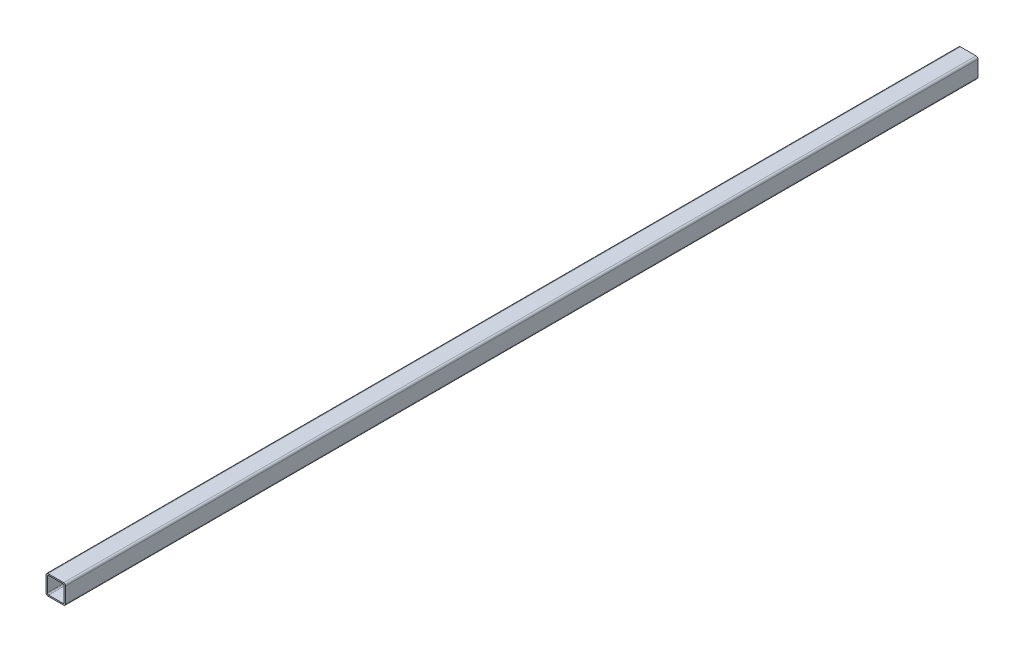
ISO-10303-21;
HEADER;
FILE_DESCRIPTION(('STEP AP214'),'2;1');
FILE_NAME('part.step','',(''),(''),'','','');
FILE_SCHEMA(('AUTOMOTIVE_DESIGN { 1 0 10303 214 1 1 1 1 }'));
ENDSEC;
DATA;
#1=APPLICATION_CONTEXT('core data for automotive mechanical design processes');
#2=APPLICATION_PROTOCOL_DEFINITION('international standard','automotive_design',2000,#1);
#3=PRODUCT_CONTEXT('',#1,'mechanical');
#4=PRODUCT('Part','Part','',(#3));
#5=PRODUCT_RELATED_PRODUCT_CATEGORY('part','',(#4));
#6=PRODUCT_DEFINITION_FORMATION('','',#4);
#7=PRODUCT_DEFINITION_CONTEXT('part definition',#1,'design');
#8=PRODUCT_DEFINITION('design','',#6,#7);
#9=PRODUCT_DEFINITION_SHAPE('','',#8);
#10=(LENGTH_UNIT() NAMED_UNIT(*) SI_UNIT(.MILLI.,.METRE.));
#11=(NAMED_UNIT(*) PLANE_ANGLE_UNIT() SI_UNIT($,.RADIAN.));
#12=(NAMED_UNIT(*) SI_UNIT($,.STERADIAN.) SOLID_ANGLE_UNIT());
#13=UNCERTAINTY_MEASURE_WITH_UNIT(LENGTH_MEASURE(1.E-05),#10,'distance_accuracy_value','');
#14=(GEOMETRIC_REPRESENTATION_CONTEXT(3) GLOBAL_UNCERTAINTY_ASSIGNED_CONTEXT((#13)) GLOBAL_UNIT_ASSIGNED_CONTEXT((#10,
#11,#12)) REPRESENTATION_CONTEXT('',''));
#15=CARTESIAN_POINT('',(0.,0.,0.));
#16=DIRECTION('',(0.,0.,1.));
#17=DIRECTION('',(1.,0.,0.));
#18=AXIS2_PLACEMENT_3D('',#15,#16,#17);
#19=CARTESIAN_POINT('',(-28.3889209690526,12.,742.426406871193));
#20=DIRECTION('',(1.,0.,0.));
#21=DIRECTION('',(0.,0.,-1.));
#22=AXIS2_PLACEMENT_3D('',#19,#20,#21);
#23=PLANE('',#22);
#24=DIRECTION('',(0.,-1.,0.));
#25=VECTOR('',#24,1.);
#26=CARTESIAN_POINT('',(-28.3889209690526,12.,700.));
#27=LINE('',#26,#25);
#28=CARTESIAN_POINT('',(-28.3889209690526,12.,700.));
#29=VERTEX_POINT('',#28);
#30=CARTESIAN_POINT('',(-28.3889209690526,-12.,700.));
#31=VERTEX_POINT('',#30);
#32=EDGE_CURVE('E196',#29,#31,#27,.T.);
#33=ORIENTED_EDGE('',*,*,#32,.F.);
#34=DIRECTION('',(0.,0.,-1.));
#35=VECTOR('',#34,1.);
#36=CARTESIAN_POINT('',(-28.3889209690526,12.,742.426406871193));
#37=LINE('',#36,#35);
#38=CARTESIAN_POINT('',(-28.3889209690526,12.,-700.));
#39=VERTEX_POINT('',#38);
#40=EDGE_CURVE('E49',#29,#39,#37,.T.);
#41=ORIENTED_EDGE('',*,*,#40,.T.);
#42=DIRECTION('',(0.,-1.,0.));
#43=VECTOR('',#42,1.);
#44=CARTESIAN_POINT('',(-28.3889209690526,12.,-700.));
#45=LINE('',#44,#43);
#46=CARTESIAN_POINT('',(-28.3889209690526,-12.,-700.));
#47=VERTEX_POINT('',#46);
#48=EDGE_CURVE('E272',#39,#47,#45,.T.);
#49=ORIENTED_EDGE('',*,*,#48,.T.);
#50=DIRECTION('',(0.,0.,-1.));
#51=VECTOR('',#50,1.);
#52=CARTESIAN_POINT('',(-28.3889209690526,-12.,742.426406871193));
#53=LINE('',#52,#51);
#54=EDGE_CURVE('E232',#31,#47,#53,.T.);
#55=ORIENTED_EDGE('',*,*,#54,.F.);
#56=EDGE_LOOP('',(#33,#41,#49,#55));
#57=FACE_BOUND('',#56,.T.);
#58=ADVANCED_FACE('F34',(#57),#23,.F.);
#59=CARTESIAN_POINT('',(-25.3889209690526,12.,742.426406871193));
#60=DIRECTION('',(0.,0.,-1.));
#61=DIRECTION('',(-1.,0.,0.));
#62=AXIS2_PLACEMENT_3D('',#59,#60,#61);
#63=CYLINDRICAL_SURFACE('',#62,3.);
#64=CARTESIAN_POINT('',(-25.3889209690526,12.,700.));
#65=DIRECTION('',(0.,0.,1.));
#66=DIRECTION('',(1.,0.,0.));
#67=AXIS2_PLACEMENT_3D('',#64,#65,#66);
#68=CIRCLE('',#67,3.);
#69=CARTESIAN_POINT('',(-25.3889209690525,15.,700.));
#70=VERTEX_POINT('',#69);
#71=EDGE_CURVE('E199',#70,#29,#68,.T.);
#72=ORIENTED_EDGE('',*,*,#71,.F.);
#73=DIRECTION('',(0.,0.,-1.));
#74=VECTOR('',#73,1.);
#75=CARTESIAN_POINT('',(-25.3889209690525,15.,742.426406871193));
#76=LINE('',#75,#74);
#77=CARTESIAN_POINT('',(-25.3889209690525,15.,-700.));
#78=VERTEX_POINT('',#77);
#79=EDGE_CURVE('E235',#70,#78,#76,.T.);
#80=ORIENTED_EDGE('',*,*,#79,.T.);
#81=CARTESIAN_POINT('',(-25.3889209690526,12.,-700.));
#82=DIRECTION('',(0.,0.,1.));
#83=DIRECTION('',(1.,0.,0.));
#84=AXIS2_PLACEMENT_3D('',#81,#82,#83);
#85=CIRCLE('',#84,3.);
#86=EDGE_CURVE('E270',#78,#39,#85,.T.);
#87=ORIENTED_EDGE('',*,*,#86,.T.);
#88=ORIENTED_EDGE('',*,*,#40,.F.);
#89=EDGE_LOOP('',(#72,#80,#87,#88));
#90=FACE_BOUND('',#89,.T.);
#91=ADVANCED_FACE('F320',(#90),#63,.T.);
#92=CARTESIAN_POINT('',(-25.3889209690525,15.,742.426406871193));
#93=DIRECTION('',(0.,-1.,0.));
#94=DIRECTION('',(0.,0.,-1.));
#95=AXIS2_PLACEMENT_3D('',#92,#93,#94);
#96=PLANE('',#95);
#97=DIRECTION('',(-1.,0.,0.));
#98=VECTOR('',#97,1.);
#99=CARTESIAN_POINT('',(-25.3889209690525,15.,700.));
#100=LINE('',#99,#98);
#101=CARTESIAN_POINT('',(-1.38892096905256,15.,700.));
#102=VERTEX_POINT('',#101);
#103=EDGE_CURVE('E202',#102,#70,#100,.T.);
#104=ORIENTED_EDGE('',*,*,#103,.F.);
#105=DIRECTION('',(0.,0.,-1.));
#106=VECTOR('',#105,1.);
#107=CARTESIAN_POINT('',(-1.38892096905256,15.,742.426406871193));
#108=LINE('',#107,#106);
#109=CARTESIAN_POINT('',(-1.38892096905256,15.,-700.));
#110=VERTEX_POINT('',#109);
#111=EDGE_CURVE('E237',#102,#110,#108,.T.);
#112=ORIENTED_EDGE('',*,*,#111,.T.);
#113=DIRECTION('',(-1.,0.,0.));
#114=VECTOR('',#113,1.);
#115=CARTESIAN_POINT('',(-25.3889209690525,15.,-700.));
#116=LINE('',#115,#114);
#117=EDGE_CURVE('E267',#110,#78,#116,.T.);
#118=ORIENTED_EDGE('',*,*,#117,.T.);
#119=ORIENTED_EDGE('',*,*,#79,.F.);
#120=EDGE_LOOP('',(#104,#112,#118,#119));
#121=FACE_BOUND('',#120,.T.);
#122=ADVANCED_FACE('F325',(#121),#96,.F.);
#123=CARTESIAN_POINT('',(-1.38892096905256,12.,742.426406871193));
#124=DIRECTION('',(0.,0.,-1.));
#125=DIRECTION('',(-1.,0.,0.));
#126=AXIS2_PLACEMENT_3D('',#123,#124,#125);
#127=CYLINDRICAL_SURFACE('',#126,3.);
#128=CARTESIAN_POINT('',(-1.38892096905256,12.,700.));
#129=DIRECTION('',(0.,0.,1.));
#130=DIRECTION('',(1.,0.,0.));
#131=AXIS2_PLACEMENT_3D('',#128,#129,#130);
#132=CIRCLE('',#131,3.);
#133=CARTESIAN_POINT('',(1.61107903094744,12.,700.));
#134=VERTEX_POINT('',#133);
#135=EDGE_CURVE('E205',#134,#102,#132,.T.);
#136=ORIENTED_EDGE('',*,*,#135,.F.);
#137=DIRECTION('',(0.,0.,-1.));
#138=VECTOR('',#137,1.);
#139=CARTESIAN_POINT('',(1.61107903094744,12.,742.426406871193));
#140=LINE('',#139,#138);
#141=CARTESIAN_POINT('',(1.61107903094744,12.,-700.));
#142=VERTEX_POINT('',#141);
#143=EDGE_CURVE('E239',#134,#142,#140,.T.);
#144=ORIENTED_EDGE('',*,*,#143,.T.);
#145=CARTESIAN_POINT('',(-1.38892096905256,12.,-700.));
#146=DIRECTION('',(0.,0.,1.));
#147=DIRECTION('',(1.,0.,0.));
#148=AXIS2_PLACEMENT_3D('',#145,#146,#147);
#149=CIRCLE('',#148,3.);
#150=EDGE_CURVE('E264',#142,#110,#149,.T.);
#151=ORIENTED_EDGE('',*,*,#150,.T.);
#152=ORIENTED_EDGE('',*,*,#111,.F.);
#153=EDGE_LOOP('',(#136,#144,#151,#152));
#154=FACE_BOUND('',#153,.T.);
#155=ADVANCED_FACE('F330',(#154),#127,.T.);
#156=CARTESIAN_POINT('',(1.61107903094744,12.,742.426406871193));
#157=DIRECTION('',(-1.,0.,0.));
#158=DIRECTION('',(0.,-1.,0.));
#159=AXIS2_PLACEMENT_3D('',#156,#157,#158);
#160=PLANE('',#159);
#161=DIRECTION('',(0.,1.,0.));
#162=VECTOR('',#161,1.);
#163=CARTESIAN_POINT('',(1.61107903094744,12.,700.));
#164=LINE('',#163,#162);
#165=CARTESIAN_POINT('',(1.61107903094744,-12.,700.));
#166=VERTEX_POINT('',#165);
#167=EDGE_CURVE('E208',#166,#134,#164,.T.);
#168=ORIENTED_EDGE('',*,*,#167,.F.);
#169=DIRECTION('',(0.,0.,-1.));
#170=VECTOR('',#169,1.);
#171=CARTESIAN_POINT('',(1.61107903094744,-12.,742.426406871193));
#172=LINE('',#171,#170);
#173=CARTESIAN_POINT('',(1.61107903094744,-12.,-700.));
#174=VERTEX_POINT('',#173);
#175=EDGE_CURVE('E241',#166,#174,#172,.T.);
#176=ORIENTED_EDGE('',*,*,#175,.T.);
#177=DIRECTION('',(0.,1.,0.));
#178=VECTOR('',#177,1.);
#179=CARTESIAN_POINT('',(1.61107903094744,12.,-700.));
#180=LINE('',#179,#178);
#181=EDGE_CURVE('E259',#174,#142,#180,.T.);
#182=ORIENTED_EDGE('',*,*,#181,.T.);
#183=ORIENTED_EDGE('',*,*,#143,.F.);
#184=EDGE_LOOP('',(#168,#176,#182,#183));
#185=FACE_BOUND('',#184,.T.);
#186=ADVANCED_FACE('F334',(#185),#160,.F.);
#187=CARTESIAN_POINT('',(-1.38892096905256,-12.,742.426406871193));
#188=DIRECTION('',(0.,0.,-1.));
#189=DIRECTION('',(-1.,0.,0.));
#190=AXIS2_PLACEMENT_3D('',#187,#188,#189);
#191=CYLINDRICAL_SURFACE('',#190,3.);
#192=CARTESIAN_POINT('',(-1.38892096905256,-12.,700.));
#193=DIRECTION('',(0.,0.,1.));
#194=DIRECTION('',(1.,0.,0.));
#195=AXIS2_PLACEMENT_3D('',#192,#193,#194);
#196=CIRCLE('',#195,3.);
#197=CARTESIAN_POINT('',(-1.38892096905256,-15.,700.));
#198=VERTEX_POINT('',#197);
#199=EDGE_CURVE('E211',#198,#166,#196,.T.);
#200=ORIENTED_EDGE('',*,*,#199,.F.);
#201=DIRECTION('',(0.,0.,-1.));
#202=VECTOR('',#201,1.);
#203=CARTESIAN_POINT('',(-1.38892096905256,-15.,742.426406871193));
#204=LINE('',#203,#202);
#205=CARTESIAN_POINT('',(-1.38892096905256,-15.,-700.));
#206=VERTEX_POINT('',#205);
#207=EDGE_CURVE('E243',#198,#206,#204,.T.);
#208=ORIENTED_EDGE('',*,*,#207,.T.);
#209=CARTESIAN_POINT('',(-1.38892096905256,-12.,-700.));
#210=DIRECTION('',(0.,0.,1.));
#211=DIRECTION('',(1.,0.,0.));
#212=AXIS2_PLACEMENT_3D('',#209,#210,#211);
#213=CIRCLE('',#212,3.);
#214=EDGE_CURVE('E258',#206,#174,#213,.T.);
#215=ORIENTED_EDGE('',*,*,#214,.T.);
#216=ORIENTED_EDGE('',*,*,#175,.F.);
#217=EDGE_LOOP('',(#200,#208,#215,#216));
#218=FACE_BOUND('',#217,.T.);
#219=ADVANCED_FACE('F338',(#218),#191,.T.);
#220=CARTESIAN_POINT('',(-25.3889209690526,-15.,742.426406871193));
#221=DIRECTION('',(0.,1.,0.));
#222=DIRECTION('',(-1.,0.,0.));
#223=AXIS2_PLACEMENT_3D('',#220,#221,#222);
#224=PLANE('',#223);
#225=DIRECTION('',(1.,0.,0.));
#226=VECTOR('',#225,1.);
#227=CARTESIAN_POINT('',(-25.3889209690526,-15.,700.));
#228=LINE('',#227,#226);
#229=CARTESIAN_POINT('',(-25.3889209690526,-15.,700.));
#230=VERTEX_POINT('',#229);
#231=EDGE_CURVE('E214',#230,#198,#228,.T.);
#232=ORIENTED_EDGE('',*,*,#231,.F.);
#233=DIRECTION('',(0.,0.,-1.));
#234=VECTOR('',#233,1.);
#235=CARTESIAN_POINT('',(-25.3889209690526,-15.,742.426406871193));
#236=LINE('',#235,#234);
#237=CARTESIAN_POINT('',(-25.3889209690526,-15.,-700.));
#238=VERTEX_POINT('',#237);
#239=EDGE_CURVE('E42',#230,#238,#236,.T.);
#240=ORIENTED_EDGE('',*,*,#239,.T.);
#241=DIRECTION('',(1.,0.,0.));
#242=VECTOR('',#241,1.);
#243=CARTESIAN_POINT('',(-25.3889209690526,-15.,-700.));
#244=LINE('',#243,#242);
#245=EDGE_CURVE('E177',#238,#206,#244,.T.);
#246=ORIENTED_EDGE('',*,*,#245,.T.);
#247=ORIENTED_EDGE('',*,*,#207,.F.);
#248=EDGE_LOOP('',(#232,#240,#246,#247));
#249=FACE_BOUND('',#248,.T.);
#250=ADVANCED_FACE('F247',(#249),#224,.F.);
#251=CARTESIAN_POINT('',(-25.3889209690526,-12.,742.426406871193));
#252=DIRECTION('',(0.,0.,-1.));
#253=DIRECTION('',(-1.,0.,0.));
#254=AXIS2_PLACEMENT_3D('',#251,#252,#253);
#255=CYLINDRICAL_SURFACE('',#254,3.);
#256=CARTESIAN_POINT('',(-25.3889209690526,-12.,700.));
#257=DIRECTION('',(0.,0.,1.));
#258=DIRECTION('',(1.,0.,0.));
#259=AXIS2_PLACEMENT_3D('',#256,#257,#258);
#260=CIRCLE('',#259,3.);
#261=EDGE_CURVE('E217',#31,#230,#260,.T.);
#262=ORIENTED_EDGE('',*,*,#261,.F.);
#263=ORIENTED_EDGE('',*,*,#54,.T.);
#264=CARTESIAN_POINT('',(-25.3889209690526,-12.,-700.));
#265=DIRECTION('',(0.,0.,1.));
#266=DIRECTION('',(1.,0.,0.));
#267=AXIS2_PLACEMENT_3D('',#264,#265,#266);
#268=CIRCLE('',#267,3.);
#269=EDGE_CURVE('E172',#47,#238,#268,.T.);
#270=ORIENTED_EDGE('',*,*,#269,.T.);
#271=ORIENTED_EDGE('',*,*,#239,.F.);
#272=EDGE_LOOP('',(#262,#263,#270,#271));
#273=FACE_BOUND('',#272,.T.);
#274=ADVANCED_FACE('F36',(#273),#255,.T.);
#275=CARTESIAN_POINT('',(-26.3889209690526,11.,742.426406871193));
#276=DIRECTION('',(1.,0.,0.));
#277=DIRECTION('',(0.,0.,-1.));
#278=AXIS2_PLACEMENT_3D('',#275,#276,#277);
#279=PLANE('',#278);
#280=DIRECTION('',(0.,0.,-1.));
#281=VECTOR('',#280,1.);
#282=CARTESIAN_POINT('',(-26.3889209690526,11.,742.426406871193));
#283=LINE('',#282,#281);
#284=CARTESIAN_POINT('',(-26.3889209690526,11.,700.));
#285=VERTEX_POINT('',#284);
#286=CARTESIAN_POINT('',(-26.3889209690526,11.,-700.));
#287=VERTEX_POINT('',#286);
#288=EDGE_CURVE('E148',#285,#287,#283,.T.);
#289=ORIENTED_EDGE('',*,*,#288,.F.);
#290=DIRECTION('',(0.,-1.,0.));
#291=VECTOR('',#290,1.);
#292=CARTESIAN_POINT('',(-26.3889209690526,11.,700.));
#293=LINE('',#292,#291);
#294=CARTESIAN_POINT('',(-26.3889209690526,-11.,700.));
#295=VERTEX_POINT('',#294);
#296=EDGE_CURVE('E11',#285,#295,#293,.T.);
#297=ORIENTED_EDGE('',*,*,#296,.T.);
#298=DIRECTION('',(0.,0.,-1.));
#299=VECTOR('',#298,1.);
#300=CARTESIAN_POINT('',(-26.3889209690526,-11.,742.426406871193));
#301=LINE('',#300,#299);
#302=CARTESIAN_POINT('',(-26.3889209690526,-11.,-700.));
#303=VERTEX_POINT('',#302);
#304=EDGE_CURVE('E157',#295,#303,#301,.T.);
#305=ORIENTED_EDGE('',*,*,#304,.T.);
#306=DIRECTION('',(0.,-1.,0.));
#307=VECTOR('',#306,1.);
#308=CARTESIAN_POINT('',(-26.3889209690526,11.,-700.));
#309=LINE('',#308,#307);
#310=EDGE_CURVE('E165',#287,#303,#309,.T.);
#311=ORIENTED_EDGE('',*,*,#310,.F.);
#312=EDGE_LOOP('',(#289,#297,#305,#311));
#313=FACE_BOUND('',#312,.T.);
#314=ADVANCED_FACE('F170',(#313),#279,.T.);
#315=CARTESIAN_POINT('',(-24.3889209690526,11.,742.426406871193));
#316=DIRECTION('',(0.,0.,-1.));
#317=DIRECTION('',(-1.,0.,0.));
#318=AXIS2_PLACEMENT_3D('',#315,#316,#317);
#319=CYLINDRICAL_SURFACE('',#318,2.);
#320=DIRECTION('',(0.,0.,-1.));
#321=VECTOR('',#320,1.);
#322=CARTESIAN_POINT('',(-24.3889209690525,13.,742.426406871193));
#323=LINE('',#322,#321);
#324=CARTESIAN_POINT('',(-24.3889209690525,13.,700.));
#325=VERTEX_POINT('',#324);
#326=CARTESIAN_POINT('',(-24.3889209690525,13.,-700.));
#327=VERTEX_POINT('',#326);
#328=EDGE_CURVE('E156',#325,#327,#323,.T.);
#329=ORIENTED_EDGE('',*,*,#328,.F.);
#330=CARTESIAN_POINT('',(-24.3889209690526,11.,700.));
#331=DIRECTION('',(0.,0.,1.));
#332=DIRECTION('',(1.,0.,0.));
#333=AXIS2_PLACEMENT_3D('',#330,#331,#332);
#334=CIRCLE('',#333,2.);
#335=EDGE_CURVE('E153',#325,#285,#334,.T.);
#336=ORIENTED_EDGE('',*,*,#335,.T.);
#337=ORIENTED_EDGE('',*,*,#288,.T.);
#338=CARTESIAN_POINT('',(-24.3889209690526,11.,-700.));
#339=DIRECTION('',(0.,0.,1.));
#340=DIRECTION('',(1.,0.,0.));
#341=AXIS2_PLACEMENT_3D('',#338,#339,#340);
#342=CIRCLE('',#341,2.);
#343=EDGE_CURVE('E152',#327,#287,#342,.T.);
#344=ORIENTED_EDGE('',*,*,#343,.F.);
#345=EDGE_LOOP('',(#329,#336,#337,#344));
#346=FACE_BOUND('',#345,.T.);
#347=ADVANCED_FACE('F151',(#346),#319,.F.);
#348=CARTESIAN_POINT('',(-24.3889209690525,13.,742.426406871193));
#349=DIRECTION('',(0.,-1.,0.));
#350=DIRECTION('',(0.,0.,-1.));
#351=AXIS2_PLACEMENT_3D('',#348,#349,#350);
#352=PLANE('',#351);
#353=DIRECTION('',(0.,0.,-1.));
#354=VECTOR('',#353,1.);
#355=CARTESIAN_POINT('',(-2.38892096905258,13.,742.426406871193));
#356=LINE('',#355,#354);
#357=CARTESIAN_POINT('',(-2.38892096905258,13.,700.));
#358=VERTEX_POINT('',#357);
#359=CARTESIAN_POINT('',(-2.38892096905258,13.,-700.));
#360=VERTEX_POINT('',#359);
#361=EDGE_CURVE('E222',#358,#360,#356,.T.);
#362=ORIENTED_EDGE('',*,*,#361,.F.);
#363=DIRECTION('',(-1.,0.,0.));
#364=VECTOR('',#363,1.);
#365=CARTESIAN_POINT('',(-24.3889209690525,13.,700.));
#366=LINE('',#365,#364);
#367=EDGE_CURVE('E174',#358,#325,#366,.T.);
#368=ORIENTED_EDGE('',*,*,#367,.T.);
#369=ORIENTED_EDGE('',*,*,#328,.T.);
#370=DIRECTION('',(-1.,0.,0.));
#371=VECTOR('',#370,1.);
#372=CARTESIAN_POINT('',(-24.3889209690525,13.,-700.));
#373=LINE('',#372,#371);
#374=EDGE_CURVE('E168',#360,#327,#373,.T.);
#375=ORIENTED_EDGE('',*,*,#374,.F.);
#376=EDGE_LOOP('',(#362,#368,#369,#375));
#377=FACE_BOUND('',#376,.T.);
#378=ADVANCED_FACE('F293',(#377),#352,.T.);
#379=CARTESIAN_POINT('',(-2.38892096905256,11.,742.426406871193));
#380=DIRECTION('',(0.,0.,-1.));
#381=DIRECTION('',(-1.,0.,0.));
#382=AXIS2_PLACEMENT_3D('',#379,#380,#381);
#383=CYLINDRICAL_SURFACE('',#382,2.);
#384=DIRECTION('',(0.,0.,-1.));
#385=VECTOR('',#384,1.);
#386=CARTESIAN_POINT('',(-0.388920969052561,11.,742.426406871193));
#387=LINE('',#386,#385);
#388=CARTESIAN_POINT('',(-0.388920969052561,11.,700.));
#389=VERTEX_POINT('',#388);
#390=CARTESIAN_POINT('',(-0.388920969052561,11.,-700.));
#391=VERTEX_POINT('',#390);
#392=EDGE_CURVE('E224',#389,#391,#387,.T.);
#393=ORIENTED_EDGE('',*,*,#392,.F.);
#394=CARTESIAN_POINT('',(-2.38892096905256,11.,700.));
#395=DIRECTION('',(0.,0.,1.));
#396=DIRECTION('',(1.,0.,0.));
#397=AXIS2_PLACEMENT_3D('',#394,#395,#396);
#398=CIRCLE('',#397,2.);
#399=EDGE_CURVE('E183',#389,#358,#398,.T.);
#400=ORIENTED_EDGE('',*,*,#399,.T.);
#401=ORIENTED_EDGE('',*,*,#361,.T.);
#402=CARTESIAN_POINT('',(-2.38892096905256,11.,-700.));
#403=DIRECTION('',(0.,0.,1.));
#404=DIRECTION('',(1.,0.,0.));
#405=AXIS2_PLACEMENT_3D('',#402,#403,#404);
#406=CIRCLE('',#405,2.);
#407=EDGE_CURVE('E285',#391,#360,#406,.T.);
#408=ORIENTED_EDGE('',*,*,#407,.F.);
#409=EDGE_LOOP('',(#393,#400,#401,#408));
#410=FACE_BOUND('',#409,.T.);
#411=ADVANCED_FACE('F297',(#410),#383,.F.);
#412=CARTESIAN_POINT('',(-0.388920969052561,11.,742.426406871193));
#413=DIRECTION('',(-1.,0.,0.));
#414=DIRECTION('',(0.,0.,1.));
#415=AXIS2_PLACEMENT_3D('',#412,#413,#414);
#416=PLANE('',#415);
#417=DIRECTION('',(0.,0.,-1.));
#418=VECTOR('',#417,1.);
#419=CARTESIAN_POINT('',(-0.388920969052561,-11.,742.426406871193));
#420=LINE('',#419,#418);
#421=CARTESIAN_POINT('',(-0.388920969052561,-11.,700.));
#422=VERTEX_POINT('',#421);
#423=CARTESIAN_POINT('',(-0.388920969052561,-11.,-700.));
#424=VERTEX_POINT('',#423);
#425=EDGE_CURVE('E226',#422,#424,#420,.T.);
#426=ORIENTED_EDGE('',*,*,#425,.F.);
#427=DIRECTION('',(0.,1.,0.));
#428=VECTOR('',#427,1.);
#429=CARTESIAN_POINT('',(-0.388920969052561,11.,700.));
#430=LINE('',#429,#428);
#431=EDGE_CURVE('E186',#422,#389,#430,.T.);
#432=ORIENTED_EDGE('',*,*,#431,.T.);
#433=ORIENTED_EDGE('',*,*,#392,.T.);
#434=DIRECTION('',(0.,1.,0.));
#435=VECTOR('',#434,1.);
#436=CARTESIAN_POINT('',(-0.388920969052561,11.,-700.));
#437=LINE('',#436,#435);
#438=EDGE_CURVE('E282',#424,#391,#437,.T.);
#439=ORIENTED_EDGE('',*,*,#438,.F.);
#440=EDGE_LOOP('',(#426,#432,#433,#439));
#441=FACE_BOUND('',#440,.T.);
#442=ADVANCED_FACE('F299',(#441),#416,.T.);
#443=CARTESIAN_POINT('',(-2.38892096905256,-11.,742.426406871193));
#444=DIRECTION('',(0.,0.,-1.));
#445=DIRECTION('',(-1.,0.,0.));
#446=AXIS2_PLACEMENT_3D('',#443,#444,#445);
#447=CYLINDRICAL_SURFACE('',#446,2.);
#448=DIRECTION('',(0.,0.,-1.));
#449=VECTOR('',#448,1.);
#450=CARTESIAN_POINT('',(-2.38892096905258,-13.,742.426406871193));
#451=LINE('',#450,#449);
#452=CARTESIAN_POINT('',(-2.38892096905258,-13.,700.));
#453=VERTEX_POINT('',#452);
#454=CARTESIAN_POINT('',(-2.38892096905258,-13.,-700.));
#455=VERTEX_POINT('',#454);
#456=EDGE_CURVE('E228',#453,#455,#451,.T.);
#457=ORIENTED_EDGE('',*,*,#456,.F.);
#458=CARTESIAN_POINT('',(-2.38892096905256,-11.,700.));
#459=DIRECTION('',(0.,0.,1.));
#460=DIRECTION('',(1.,0.,0.));
#461=AXIS2_PLACEMENT_3D('',#458,#459,#460);
#462=CIRCLE('',#461,2.);
#463=EDGE_CURVE('E189',#453,#422,#462,.T.);
#464=ORIENTED_EDGE('',*,*,#463,.T.);
#465=ORIENTED_EDGE('',*,*,#425,.T.);
#466=CARTESIAN_POINT('',(-2.38892096905256,-11.,-700.));
#467=DIRECTION('',(0.,0.,1.));
#468=DIRECTION('',(1.,0.,0.));
#469=AXIS2_PLACEMENT_3D('',#466,#467,#468);
#470=CIRCLE('',#469,2.);
#471=EDGE_CURVE('E279',#455,#424,#470,.T.);
#472=ORIENTED_EDGE('',*,*,#471,.F.);
#473=EDGE_LOOP('',(#457,#464,#465,#472));
#474=FACE_BOUND('',#473,.T.);
#475=ADVANCED_FACE('F303',(#474),#447,.F.);
#476=CARTESIAN_POINT('',(-24.3889209690525,-13.,742.426406871193));
#477=DIRECTION('',(0.,1.,0.));
#478=DIRECTION('',(0.,0.,1.));
#479=AXIS2_PLACEMENT_3D('',#476,#477,#478);
#480=PLANE('',#479);
#481=DIRECTION('',(0.,0.,-1.));
#482=VECTOR('',#481,1.);
#483=CARTESIAN_POINT('',(-24.3889209690525,-13.,742.426406871193));
#484=LINE('',#483,#482);
#485=CARTESIAN_POINT('',(-24.3889209690525,-13.,700.));
#486=VERTEX_POINT('',#485);
#487=CARTESIAN_POINT('',(-24.3889209690525,-13.,-700.));
#488=VERTEX_POINT('',#487);
#489=EDGE_CURVE('E230',#486,#488,#484,.T.);
#490=ORIENTED_EDGE('',*,*,#489,.F.);
#491=DIRECTION('',(1.,0.,0.));
#492=VECTOR('',#491,1.);
#493=CARTESIAN_POINT('',(-24.3889209690525,-13.,700.));
#494=LINE('',#493,#492);
#495=EDGE_CURVE('E192',#486,#453,#494,.T.);
#496=ORIENTED_EDGE('',*,*,#495,.T.);
#497=ORIENTED_EDGE('',*,*,#456,.T.);
#498=DIRECTION('',(1.,0.,0.));
#499=VECTOR('',#498,1.);
#500=CARTESIAN_POINT('',(-24.3889209690525,-13.,-700.));
#501=LINE('',#500,#499);
#502=EDGE_CURVE('E276',#488,#455,#501,.T.);
#503=ORIENTED_EDGE('',*,*,#502,.F.);
#504=EDGE_LOOP('',(#490,#496,#497,#503));
#505=FACE_BOUND('',#504,.T.);
#506=ADVANCED_FACE('F307',(#505),#480,.T.);
#507=CARTESIAN_POINT('',(-24.3889209690526,-11.,742.426406871193));
#508=DIRECTION('',(0.,0.,-1.));
#509=DIRECTION('',(-1.,0.,0.));
#510=AXIS2_PLACEMENT_3D('',#507,#508,#509);
#511=CYLINDRICAL_SURFACE('',#510,2.);
#512=ORIENTED_EDGE('',*,*,#304,.F.);
#513=CARTESIAN_POINT('',(-24.3889209690526,-11.,700.));
#514=DIRECTION('',(0.,0.,1.));
#515=DIRECTION('',(1.,0.,0.));
#516=AXIS2_PLACEMENT_3D('',#513,#514,#515);
#517=CIRCLE('',#516,2.);
#518=EDGE_CURVE('E57',#295,#486,#517,.T.);
#519=ORIENTED_EDGE('',*,*,#518,.T.);
#520=ORIENTED_EDGE('',*,*,#489,.T.);
#521=CARTESIAN_POINT('',(-24.3889209690526,-11.,-700.));
#522=DIRECTION('',(0.,0.,1.));
#523=DIRECTION('',(1.,0.,0.));
#524=AXIS2_PLACEMENT_3D('',#521,#522,#523);
#525=CIRCLE('',#524,2.);
#526=EDGE_CURVE('E274',#303,#488,#525,.T.);
#527=ORIENTED_EDGE('',*,*,#526,.F.);
#528=EDGE_LOOP('',(#512,#519,#520,#527));
#529=FACE_BOUND('',#528,.T.);
#530=ADVANCED_FACE('F309',(#529),#511,.F.);
#531=CARTESIAN_POINT('',(3.648014009162,-41.0804943552744,700.));
#532=DIRECTION('',(0.,0.,1.));
#533=DIRECTION('',(1.,0.,0.));
#534=AXIS2_PLACEMENT_3D('',#531,#532,#533);
#535=PLANE('',#534);
#536=ORIENTED_EDGE('',*,*,#518,.F.);
#537=ORIENTED_EDGE('',*,*,#296,.F.);
#538=ORIENTED_EDGE('',*,*,#335,.F.);
#539=ORIENTED_EDGE('',*,*,#367,.F.);
#540=ORIENTED_EDGE('',*,*,#399,.F.);
#541=ORIENTED_EDGE('',*,*,#431,.F.);
#542=ORIENTED_EDGE('',*,*,#463,.F.);
#543=ORIENTED_EDGE('',*,*,#495,.F.);
#544=EDGE_LOOP('',(#536,#537,#538,#539,#540,#541,#542,#543));
#545=FACE_BOUND('',#544,.T.);
#546=ORIENTED_EDGE('',*,*,#32,.T.);
#547=ORIENTED_EDGE('',*,*,#261,.T.);
#548=ORIENTED_EDGE('',*,*,#231,.T.);
#549=ORIENTED_EDGE('',*,*,#199,.T.);
#550=ORIENTED_EDGE('',*,*,#167,.T.);
#551=ORIENTED_EDGE('',*,*,#135,.T.);
#552=ORIENTED_EDGE('',*,*,#103,.T.);
#553=ORIENTED_EDGE('',*,*,#71,.T.);
#554=EDGE_LOOP('',(#546,#547,#548,#549,#550,#551,#552,#553));
#555=FACE_BOUND('',#554,.T.);
#556=ADVANCED_FACE('F294',(#545,#555),#535,.T.);
#557=CARTESIAN_POINT('',(3.648014009162,-41.0804943552744,-700.));
#558=DIRECTION('',(0.,0.,-1.));
#559=DIRECTION('',(1.,0.,0.));
#560=AXIS2_PLACEMENT_3D('',#557,#558,#559);
#561=PLANE('',#560);
#562=ORIENTED_EDGE('',*,*,#526,.T.);
#563=ORIENTED_EDGE('',*,*,#502,.T.);
#564=ORIENTED_EDGE('',*,*,#471,.T.);
#565=ORIENTED_EDGE('',*,*,#438,.T.);
#566=ORIENTED_EDGE('',*,*,#407,.T.);
#567=ORIENTED_EDGE('',*,*,#374,.T.);
#568=ORIENTED_EDGE('',*,*,#343,.T.);
#569=ORIENTED_EDGE('',*,*,#310,.T.);
#570=EDGE_LOOP('',(#562,#563,#564,#565,#566,#567,#568,#569));
#571=FACE_BOUND('',#570,.T.);
#572=ORIENTED_EDGE('',*,*,#48,.F.);
#573=ORIENTED_EDGE('',*,*,#86,.F.);
#574=ORIENTED_EDGE('',*,*,#117,.F.);
#575=ORIENTED_EDGE('',*,*,#150,.F.);
#576=ORIENTED_EDGE('',*,*,#181,.F.);
#577=ORIENTED_EDGE('',*,*,#214,.F.);
#578=ORIENTED_EDGE('',*,*,#245,.F.);
#579=ORIENTED_EDGE('',*,*,#269,.F.);
#580=EDGE_LOOP('',(#572,#573,#574,#575,#576,#577,#578,#579));
#581=FACE_BOUND('',#580,.T.);
#582=ADVANCED_FACE('F163',(#571,#581),#561,.T.);
#583=CLOSED_SHELL('',(#58,#91,#122,#155,#186,#219,#250,#274,#314,#347,#378,#411,#442,#475,#506,
#530,#556,#582));
#584=MANIFOLD_SOLID_BREP('B2',#583);
#585=ADVANCED_BREP_SHAPE_REPRESENTATION('',(#18,#584),#14);
#586=SHAPE_DEFINITION_REPRESENTATION(#9,#585);
ENDSEC;
END-ISO-10303-21;
